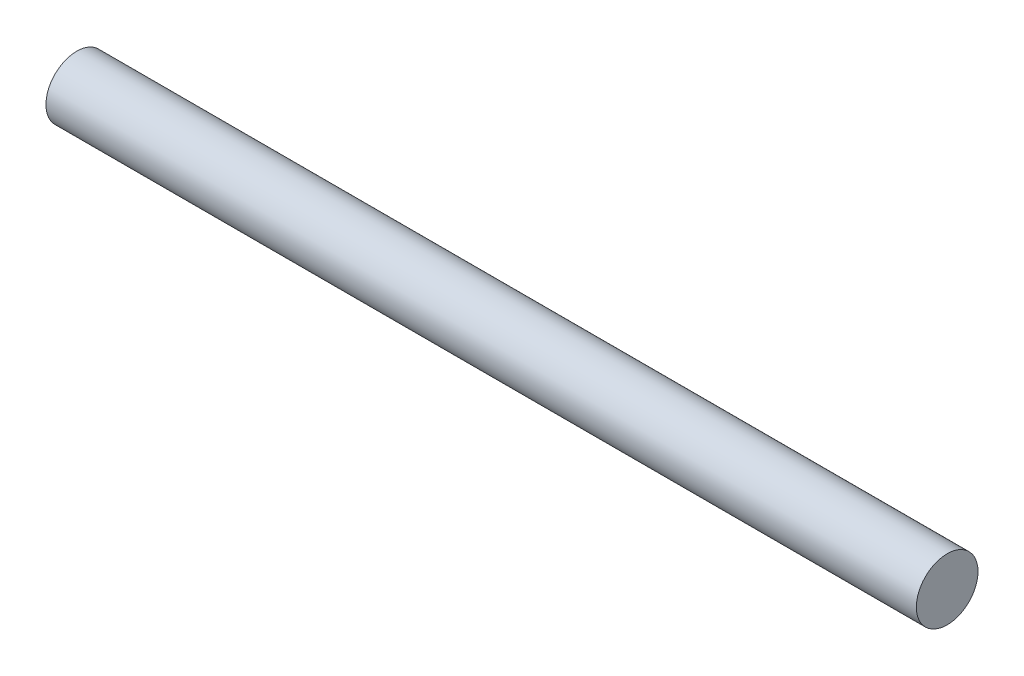
ISO-10303-21;
HEADER;
FILE_DESCRIPTION(('STEP AP214'),'2;1');
FILE_NAME('part.step','',(''),(''),'','','');
FILE_SCHEMA(('AUTOMOTIVE_DESIGN { 1 0 10303 214 1 1 1 1 }'));
ENDSEC;
DATA;
#1=APPLICATION_CONTEXT('core data for automotive mechanical design processes');
#2=APPLICATION_PROTOCOL_DEFINITION('international standard','automotive_design',2000,#1);
#3=PRODUCT_CONTEXT('',#1,'mechanical');
#4=PRODUCT('Part','Part','',(#3));
#5=PRODUCT_RELATED_PRODUCT_CATEGORY('part','',(#4));
#6=PRODUCT_DEFINITION_FORMATION('','',#4);
#7=PRODUCT_DEFINITION_CONTEXT('part definition',#1,'design');
#8=PRODUCT_DEFINITION('design','',#6,#7);
#9=PRODUCT_DEFINITION_SHAPE('','',#8);
#10=(LENGTH_UNIT() NAMED_UNIT(*) SI_UNIT(.MILLI.,.METRE.));
#11=(NAMED_UNIT(*) PLANE_ANGLE_UNIT() SI_UNIT($,.RADIAN.));
#12=(NAMED_UNIT(*) SI_UNIT($,.STERADIAN.) SOLID_ANGLE_UNIT());
#13=UNCERTAINTY_MEASURE_WITH_UNIT(LENGTH_MEASURE(1.E-05),#10,'distance_accuracy_value','');
#14=(GEOMETRIC_REPRESENTATION_CONTEXT(3) GLOBAL_UNCERTAINTY_ASSIGNED_CONTEXT((#13)) GLOBAL_UNIT_ASSIGNED_CONTEXT((#10,
#11,#12)) REPRESENTATION_CONTEXT('',''));
#15=CARTESIAN_POINT('',(0.,0.,0.));
#16=DIRECTION('',(0.,0.,1.));
#17=DIRECTION('',(1.,0.,0.));
#18=AXIS2_PLACEMENT_3D('',#15,#16,#17);
#19=CARTESIAN_POINT('',(152.4,0.,0.));
#20=DIRECTION('',(-1.,0.,0.));
#21=DIRECTION('',(0.,0.,1.));
#22=AXIS2_PLACEMENT_3D('',#19,#20,#21);
#23=CYLINDRICAL_SURFACE('',#22,10.795);
#24=CARTESIAN_POINT('',(152.4,0.,0.));
#25=DIRECTION('',(1.,0.,0.));
#26=DIRECTION('',(0.,0.,-1.));
#27=AXIS2_PLACEMENT_3D('',#24,#25,#26);
#28=CIRCLE('',#27,10.795);
#29=CARTESIAN_POINT('',(152.4,0.,-10.795));
#30=VERTEX_POINT('',#29);
#31=EDGE_CURVE('E10',#30,#30,#28,.T.);
#32=ORIENTED_EDGE('',*,*,#31,.F.);
#33=EDGE_LOOP('',(#32));
#34=FACE_BOUND('',#33,.T.);
#35=CARTESIAN_POINT('',(-152.4,0.,0.));
#36=DIRECTION('',(1.,0.,0.));
#37=DIRECTION('',(0.,0.,-1.));
#38=AXIS2_PLACEMENT_3D('',#35,#36,#37);
#39=CIRCLE('',#38,10.795);
#40=CARTESIAN_POINT('',(-152.4,0.,-10.795));
#41=VERTEX_POINT('',#40);
#42=EDGE_CURVE('E37',#41,#41,#39,.T.);
#43=ORIENTED_EDGE('',*,*,#42,.T.);
#44=EDGE_LOOP('',(#43));
#45=FACE_BOUND('',#44,.T.);
#46=ADVANCED_FACE('F34',(#34,#45),#23,.T.);
#47=CARTESIAN_POINT('',(152.4,0.,0.));
#48=DIRECTION('',(1.,0.,0.));
#49=DIRECTION('',(0.,0.,-1.));
#50=AXIS2_PLACEMENT_3D('',#47,#48,#49);
#51=PLANE('',#50);
#52=ORIENTED_EDGE('',*,*,#31,.T.);
#53=EDGE_LOOP('',(#52));
#54=FACE_BOUND('',#53,.T.);
#55=ADVANCED_FACE('F49',(#54),#51,.T.);
#56=CARTESIAN_POINT('',(-152.4,0.,0.));
#57=DIRECTION('',(1.,0.,0.));
#58=DIRECTION('',(0.,0.,-1.));
#59=AXIS2_PLACEMENT_3D('',#56,#57,#58);
#60=PLANE('',#59);
#61=ORIENTED_EDGE('',*,*,#42,.F.);
#62=EDGE_LOOP('',(#61));
#63=FACE_BOUND('',#62,.T.);
#64=ADVANCED_FACE('F47',(#63),#60,.F.);
#65=CLOSED_SHELL('',(#46,#55,#64));
#66=MANIFOLD_SOLID_BREP('B2',#65);
#67=ADVANCED_BREP_SHAPE_REPRESENTATION('',(#18,#66),#14);
#68=SHAPE_DEFINITION_REPRESENTATION(#9,#67);
ENDSEC;
END-ISO-10303-21;
